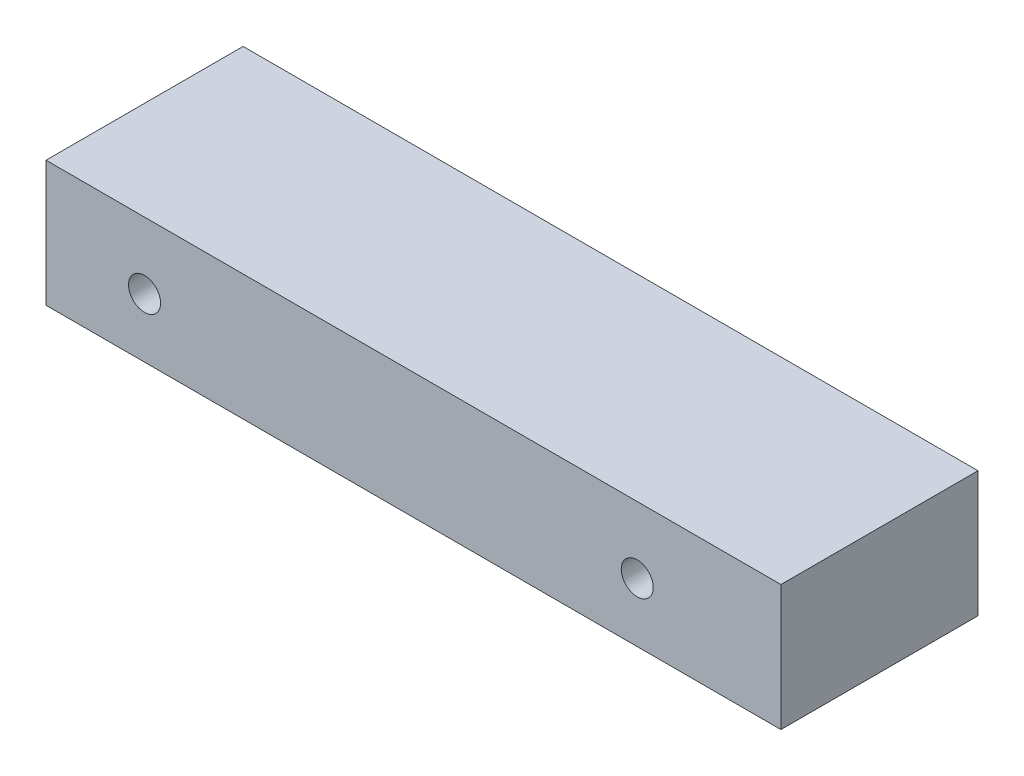
ISO-10303-21;
HEADER;
FILE_DESCRIPTION(('STEP AP214'),'2;1');
FILE_NAME('part.step','',(''),(''),'','','');
FILE_SCHEMA(('AUTOMOTIVE_DESIGN { 1 0 10303 214 1 1 1 1 }'));
ENDSEC;
DATA;
#1=APPLICATION_CONTEXT('core data for automotive mechanical design processes');
#2=APPLICATION_PROTOCOL_DEFINITION('international standard','automotive_design',2000,#1);
#3=PRODUCT_CONTEXT('',#1,'mechanical');
#4=PRODUCT('Part','Part','',(#3));
#5=PRODUCT_RELATED_PRODUCT_CATEGORY('part','',(#4));
#6=PRODUCT_DEFINITION_FORMATION('','',#4);
#7=PRODUCT_DEFINITION_CONTEXT('part definition',#1,'design');
#8=PRODUCT_DEFINITION('design','',#6,#7);
#9=PRODUCT_DEFINITION_SHAPE('','',#8);
#10=(LENGTH_UNIT() NAMED_UNIT(*) SI_UNIT(.MILLI.,.METRE.));
#11=(NAMED_UNIT(*) PLANE_ANGLE_UNIT() SI_UNIT($,.RADIAN.));
#12=(NAMED_UNIT(*) SI_UNIT($,.STERADIAN.) SOLID_ANGLE_UNIT());
#13=UNCERTAINTY_MEASURE_WITH_UNIT(LENGTH_MEASURE(1.E-05),#10,'distance_accuracy_value','');
#14=(GEOMETRIC_REPRESENTATION_CONTEXT(3) GLOBAL_UNCERTAINTY_ASSIGNED_CONTEXT((#13)) GLOBAL_UNIT_ASSIGNED_CONTEXT((#10,
#11,#12)) REPRESENTATION_CONTEXT('',''));
#15=CARTESIAN_POINT('',(0.,0.,0.));
#16=DIRECTION('',(0.,0.,1.));
#17=DIRECTION('',(1.,0.,0.));
#18=AXIS2_PLACEMENT_3D('',#15,#16,#17);
#19=CARTESIAN_POINT('',(0.,0.,-70.5119235668815));
#20=DIRECTION('',(0.,0.,-1.));
#21=DIRECTION('',(-1.,0.,0.));
#22=AXIS2_PLACEMENT_3D('',#19,#20,#21);
#23=PLANE('',#22);
#24=CARTESIAN_POINT('',(24.4373429638328,-6.75,-70.5119235668815));
#25=DIRECTION('',(0.,0.,-1.));
#26=DIRECTION('',(-1.,0.,0.));
#27=AXIS2_PLACEMENT_3D('',#24,#25,#26);
#28=CIRCLE('',#27,1.625);
#29=CARTESIAN_POINT('',(22.8123429638328,-6.75,-70.5119235668815));
#30=VERTEX_POINT('',#29);
#31=EDGE_CURVE('E112',#30,#30,#28,.T.);
#32=ORIENTED_EDGE('',*,*,#31,.F.);
#33=EDGE_LOOP('',(#32));
#34=FACE_BOUND('',#33,.T.);
#35=DIRECTION('',(0.,-1.,0.));
#36=VECTOR('',#35,1.);
#37=CARTESIAN_POINT('',(39.0181278430304,0.,-70.5119235668815));
#38=LINE('',#37,#36);
#39=CARTESIAN_POINT('',(39.0181278430304,0.,-70.5119235668815));
#40=VERTEX_POINT('',#39);
#41=CARTESIAN_POINT('',(39.0181278430304,-12.75,-70.5119235668815));
#42=VERTEX_POINT('',#41);
#43=EDGE_CURVE('E92',#40,#42,#38,.T.);
#44=ORIENTED_EDGE('',*,*,#43,.T.);
#45=DIRECTION('',(-1.,0.,0.));
#46=VECTOR('',#45,1.);
#47=CARTESIAN_POINT('',(39.0181278430304,-12.75,-70.5119235668815));
#48=LINE('',#47,#46);
#49=CARTESIAN_POINT('',(-35.5626570361672,-12.75,-70.5119235668815));
#50=VERTEX_POINT('',#49);
#51=EDGE_CURVE('E87',#42,#50,#48,.T.);
#52=ORIENTED_EDGE('',*,*,#51,.T.);
#53=DIRECTION('',(0.,1.,0.));
#54=VECTOR('',#53,1.);
#55=CARTESIAN_POINT('',(-35.5626570361672,0.,-70.5119235668815));
#56=LINE('',#55,#54);
#57=CARTESIAN_POINT('',(-35.5626570361672,0.,-70.5119235668815));
#58=VERTEX_POINT('',#57);
#59=EDGE_CURVE('E90',#50,#58,#56,.T.);
#60=ORIENTED_EDGE('',*,*,#59,.T.);
#61=DIRECTION('',(1.,0.,0.));
#62=VECTOR('',#61,1.);
#63=CARTESIAN_POINT('',(39.0181278430304,0.,-70.5119235668815));
#64=LINE('',#63,#62);
#65=EDGE_CURVE('E57',#58,#40,#64,.T.);
#66=ORIENTED_EDGE('',*,*,#65,.T.);
#67=EDGE_LOOP('',(#44,#52,#60,#66));
#68=FACE_BOUND('',#67,.T.);
#69=CARTESIAN_POINT('',(-25.5626570361672,-6.75,-70.5119235668815));
#70=DIRECTION('',(0.,0.,-1.));
#71=DIRECTION('',(-1.,0.,0.));
#72=AXIS2_PLACEMENT_3D('',#69,#70,#71);
#73=CIRCLE('',#72,1.625);
#74=CARTESIAN_POINT('',(-27.1876570361672,-6.75,-70.5119235668815));
#75=VERTEX_POINT('',#74);
#76=EDGE_CURVE('E134',#75,#75,#73,.T.);
#77=ORIENTED_EDGE('',*,*,#76,.F.);
#78=EDGE_LOOP('',(#77));
#79=FACE_BOUND('',#78,.T.);
#80=ADVANCED_FACE('F39',(#34,#68,#79),#23,.T.);
#81=CARTESIAN_POINT('',(0.,0.,-50.5119235668815));
#82=DIRECTION('',(0.,0.,-1.));
#83=DIRECTION('',(-1.,0.,0.));
#84=AXIS2_PLACEMENT_3D('',#81,#82,#83);
#85=PLANE('',#84);
#86=DIRECTION('',(0.,-1.,0.));
#87=VECTOR('',#86,1.);
#88=CARTESIAN_POINT('',(39.0181278430304,0.,-50.5119235668815));
#89=LINE('',#88,#87);
#90=CARTESIAN_POINT('',(39.0181278430304,0.,-50.5119235668815));
#91=VERTEX_POINT('',#90);
#92=CARTESIAN_POINT('',(39.0181278430304,-12.75,-50.5119235668815));
#93=VERTEX_POINT('',#92);
#94=EDGE_CURVE('E108',#91,#93,#89,.T.);
#95=ORIENTED_EDGE('',*,*,#94,.F.);
#96=DIRECTION('',(1.,0.,0.));
#97=VECTOR('',#96,1.);
#98=CARTESIAN_POINT('',(39.0181278430304,0.,-50.5119235668815));
#99=LINE('',#98,#97);
#100=CARTESIAN_POINT('',(-35.5626570361672,0.,-50.5119235668815));
#101=VERTEX_POINT('',#100);
#102=EDGE_CURVE('E80',#101,#91,#99,.T.);
#103=ORIENTED_EDGE('',*,*,#102,.F.);
#104=DIRECTION('',(0.,1.,0.));
#105=VECTOR('',#104,1.);
#106=CARTESIAN_POINT('',(-35.5626570361672,0.,-50.5119235668815));
#107=LINE('',#106,#105);
#108=CARTESIAN_POINT('',(-35.5626570361672,-12.75,-50.5119235668815));
#109=VERTEX_POINT('',#108);
#110=EDGE_CURVE('E74',#109,#101,#107,.T.);
#111=ORIENTED_EDGE('',*,*,#110,.F.);
#112=DIRECTION('',(-1.,0.,0.));
#113=VECTOR('',#112,1.);
#114=CARTESIAN_POINT('',(39.0181278430304,-12.75,-50.5119235668815));
#115=LINE('',#114,#113);
#116=EDGE_CURVE('E97',#93,#109,#115,.T.);
#117=ORIENTED_EDGE('',*,*,#116,.F.);
#118=EDGE_LOOP('',(#95,#103,#111,#117));
#119=FACE_BOUND('',#118,.T.);
#120=CARTESIAN_POINT('',(24.4373429638328,-6.75,-50.5119235668815));
#121=DIRECTION('',(0.,0.,-1.));
#122=DIRECTION('',(-1.,0.,0.));
#123=AXIS2_PLACEMENT_3D('',#120,#121,#122);
#124=CIRCLE('',#123,1.625);
#125=CARTESIAN_POINT('',(22.8123429638328,-6.75,-50.5119235668815));
#126=VERTEX_POINT('',#125);
#127=EDGE_CURVE('E130',#126,#126,#124,.T.);
#128=ORIENTED_EDGE('',*,*,#127,.T.);
#129=EDGE_LOOP('',(#128));
#130=FACE_BOUND('',#129,.T.);
#131=CARTESIAN_POINT('',(-25.5626570361672,-6.75,-50.5119235668815));
#132=DIRECTION('',(0.,0.,-1.));
#133=DIRECTION('',(-1.,0.,0.));
#134=AXIS2_PLACEMENT_3D('',#131,#132,#133);
#135=CIRCLE('',#134,1.625);
#136=CARTESIAN_POINT('',(-27.1876570361672,-6.75,-50.5119235668815));
#137=VERTEX_POINT('',#136);
#138=EDGE_CURVE('E138',#137,#137,#135,.T.);
#139=ORIENTED_EDGE('',*,*,#138,.T.);
#140=EDGE_LOOP('',(#139));
#141=FACE_BOUND('',#140,.T.);
#142=ADVANCED_FACE('F125',(#119,#130,#141),#85,.F.);
#143=CARTESIAN_POINT('',(39.0181278430304,0.,-70.5119235668815));
#144=DIRECTION('',(-1.,0.,0.));
#145=DIRECTION('',(0.,0.,1.));
#146=AXIS2_PLACEMENT_3D('',#143,#144,#145);
#147=PLANE('',#146);
#148=ORIENTED_EDGE('',*,*,#94,.T.);
#149=DIRECTION('',(0.,0.,1.));
#150=VECTOR('',#149,1.);
#151=CARTESIAN_POINT('',(39.0181278430304,-12.75,-70.5119235668815));
#152=LINE('',#151,#150);
#153=EDGE_CURVE('E11',#42,#93,#152,.T.);
#154=ORIENTED_EDGE('',*,*,#153,.F.);
#155=ORIENTED_EDGE('',*,*,#43,.F.);
#156=DIRECTION('',(0.,0.,1.));
#157=VECTOR('',#156,1.);
#158=CARTESIAN_POINT('',(39.0181278430304,0.,-70.5119235668815));
#159=LINE('',#158,#157);
#160=EDGE_CURVE('E104',#40,#91,#159,.T.);
#161=ORIENTED_EDGE('',*,*,#160,.T.);
#162=EDGE_LOOP('',(#148,#154,#155,#161));
#163=FACE_BOUND('',#162,.T.);
#164=ADVANCED_FACE('F41',(#163),#147,.F.);
#165=CARTESIAN_POINT('',(39.0181278430304,-12.75,-70.5119235668815));
#166=DIRECTION('',(0.,1.,0.));
#167=DIRECTION('',(0.,0.,1.));
#168=AXIS2_PLACEMENT_3D('',#165,#166,#167);
#169=PLANE('',#168);
#170=ORIENTED_EDGE('',*,*,#116,.T.);
#171=DIRECTION('',(0.,0.,1.));
#172=VECTOR('',#171,1.);
#173=CARTESIAN_POINT('',(-35.5626570361672,-12.75,-70.5119235668815));
#174=LINE('',#173,#172);
#175=EDGE_CURVE('E49',#50,#109,#174,.T.);
#176=ORIENTED_EDGE('',*,*,#175,.F.);
#177=ORIENTED_EDGE('',*,*,#51,.F.);
#178=ORIENTED_EDGE('',*,*,#153,.T.);
#179=EDGE_LOOP('',(#170,#176,#177,#178));
#180=FACE_BOUND('',#179,.T.);
#181=ADVANCED_FACE('F96',(#180),#169,.F.);
#182=CARTESIAN_POINT('',(-35.5626570361672,0.,-70.5119235668815));
#183=DIRECTION('',(1.,0.,0.));
#184=DIRECTION('',(0.,0.,-1.));
#185=AXIS2_PLACEMENT_3D('',#182,#183,#184);
#186=PLANE('',#185);
#187=ORIENTED_EDGE('',*,*,#110,.T.);
#188=DIRECTION('',(0.,0.,1.));
#189=VECTOR('',#188,1.);
#190=CARTESIAN_POINT('',(-35.5626570361672,0.,-70.5119235668815));
#191=LINE('',#190,#189);
#192=EDGE_CURVE('E99',#58,#101,#191,.T.);
#193=ORIENTED_EDGE('',*,*,#192,.F.);
#194=ORIENTED_EDGE('',*,*,#59,.F.);
#195=ORIENTED_EDGE('',*,*,#175,.T.);
#196=EDGE_LOOP('',(#187,#193,#194,#195));
#197=FACE_BOUND('',#196,.T.);
#198=ADVANCED_FACE('F100',(#197),#186,.F.);
#199=CARTESIAN_POINT('',(39.0181278430304,0.,-70.5119235668815));
#200=DIRECTION('',(0.,-1.,0.));
#201=DIRECTION('',(0.,0.,-1.));
#202=AXIS2_PLACEMENT_3D('',#199,#200,#201);
#203=PLANE('',#202);
#204=ORIENTED_EDGE('',*,*,#102,.T.);
#205=ORIENTED_EDGE('',*,*,#160,.F.);
#206=ORIENTED_EDGE('',*,*,#65,.F.);
#207=ORIENTED_EDGE('',*,*,#192,.T.);
#208=EDGE_LOOP('',(#204,#205,#206,#207));
#209=FACE_BOUND('',#208,.T.);
#210=ADVANCED_FACE('F122',(#209),#203,.F.);
#211=CARTESIAN_POINT('',(24.4373429638328,-6.75,-70.5119235668815));
#212=DIRECTION('',(0.,0.,1.));
#213=DIRECTION('',(1.,0.,0.));
#214=AXIS2_PLACEMENT_3D('',#211,#212,#213);
#215=CYLINDRICAL_SURFACE('',#214,1.625);
#216=ORIENTED_EDGE('',*,*,#31,.T.);
#217=EDGE_LOOP('',(#216));
#218=FACE_BOUND('',#217,.T.);
#219=ORIENTED_EDGE('',*,*,#127,.F.);
#220=EDGE_LOOP('',(#219));
#221=FACE_BOUND('',#220,.T.);
#222=ADVANCED_FACE('F157',(#218,#221),#215,.F.);
#223=CARTESIAN_POINT('',(-25.5626570361672,-6.75,-70.5119235668815));
#224=DIRECTION('',(0.,0.,1.));
#225=DIRECTION('',(1.,0.,0.));
#226=AXIS2_PLACEMENT_3D('',#223,#224,#225);
#227=CYLINDRICAL_SURFACE('',#226,1.625);
#228=ORIENTED_EDGE('',*,*,#76,.T.);
#229=EDGE_LOOP('',(#228));
#230=FACE_BOUND('',#229,.T.);
#231=ORIENTED_EDGE('',*,*,#138,.F.);
#232=EDGE_LOOP('',(#231));
#233=FACE_BOUND('',#232,.T.);
#234=ADVANCED_FACE('F146',(#230,#233),#227,.F.);
#235=CLOSED_SHELL('',(#80,#142,#164,#181,#198,#210,#222,#234));
#236=MANIFOLD_SOLID_BREP('B2',#235);
#237=ADVANCED_BREP_SHAPE_REPRESENTATION('',(#18,#236),#14);
#238=SHAPE_DEFINITION_REPRESENTATION(#9,#237);
ENDSEC;
END-ISO-10303-21;
